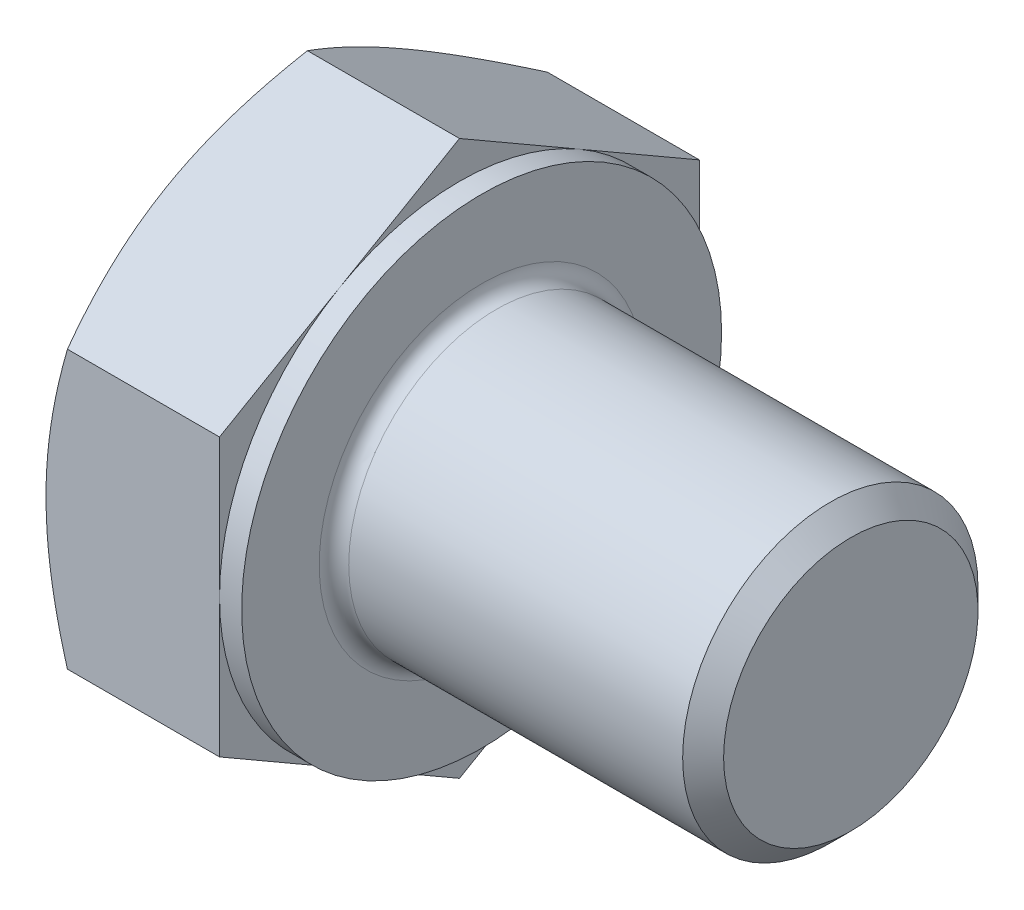
ISO-10303-21;
HEADER;
FILE_DESCRIPTION(('STEP AP214'),'2;1');
FILE_NAME('part.step','',(''),(''),'','','');
FILE_SCHEMA(('AUTOMOTIVE_DESIGN { 1 0 10303 214 1 1 1 1 }'));
ENDSEC;
DATA;
#1=APPLICATION_CONTEXT('core data for automotive mechanical design processes');
#2=APPLICATION_PROTOCOL_DEFINITION('international standard','automotive_design',2000,#1);
#3=PRODUCT_CONTEXT('',#1,'mechanical');
#4=PRODUCT('Part','Part','',(#3));
#5=PRODUCT_RELATED_PRODUCT_CATEGORY('part','',(#4));
#6=PRODUCT_DEFINITION_FORMATION('','',#4);
#7=PRODUCT_DEFINITION_CONTEXT('part definition',#1,'design');
#8=PRODUCT_DEFINITION('design','',#6,#7);
#9=PRODUCT_DEFINITION_SHAPE('','',#8);
#10=(LENGTH_UNIT() NAMED_UNIT(*) SI_UNIT(.MILLI.,.METRE.));
#11=(NAMED_UNIT(*) PLANE_ANGLE_UNIT() SI_UNIT($,.RADIAN.));
#12=(NAMED_UNIT(*) SI_UNIT($,.STERADIAN.) SOLID_ANGLE_UNIT());
#13=UNCERTAINTY_MEASURE_WITH_UNIT(LENGTH_MEASURE(1.E-05),#10,'distance_accuracy_value','');
#14=(GEOMETRIC_REPRESENTATION_CONTEXT(3) GLOBAL_UNCERTAINTY_ASSIGNED_CONTEXT((#13)) GLOBAL_UNIT_ASSIGNED_CONTEXT((#10,
#11,#12)) REPRESENTATION_CONTEXT('',''));
#15=CARTESIAN_POINT('',(0.,0.,0.));
#16=DIRECTION('',(0.,0.,1.));
#17=DIRECTION('',(1.,0.,0.));
#18=AXIS2_PLACEMENT_3D('',#15,#16,#17);
#19=CARTESIAN_POINT('',(5.3,7.50555349946514,0.));
#20=DIRECTION('',(1.,0.,0.));
#21=DIRECTION('',(0.,0.,-1.));
#22=AXIS2_PLACEMENT_3D('',#19,#20,#21);
#23=PLANE('',#22);
#24=CARTESIAN_POINT('',(5.3,0.,0.));
#25=DIRECTION('',(1.,0.,0.));
#26=DIRECTION('',(0.,0.,-1.));
#27=AXIS2_PLACEMENT_3D('',#24,#25,#26);
#28=CIRCLE('',#27,4.4);
#29=CARTESIAN_POINT('',(5.3,0.,-4.4));
#30=VERTEX_POINT('',#29);
#31=EDGE_CURVE('E44',#30,#30,#28,.F.);
#32=ORIENTED_EDGE('',*,*,#31,.T.);
#33=EDGE_LOOP('',(#32));
#34=FACE_BOUND('',#33,.T.);
#35=CARTESIAN_POINT('',(5.3,0.,0.));
#36=DIRECTION('',(1.,0.,0.));
#37=DIRECTION('',(0.,0.,-1.));
#38=AXIS2_PLACEMENT_3D('',#35,#36,#37);
#39=CIRCLE('',#38,6.5);
#40=CARTESIAN_POINT('',(5.3,0.,-6.5));
#41=VERTEX_POINT('',#40);
#42=EDGE_CURVE('E301',#41,#41,#39,.T.);
#43=ORIENTED_EDGE('',*,*,#42,.T.);
#44=EDGE_LOOP('',(#43));
#45=FACE_BOUND('',#44,.T.);
#46=ADVANCED_FACE('F36',(#34,#45),#23,.T.);
#47=CARTESIAN_POINT('',(0.,0.,0.));
#48=DIRECTION('',(-1.,0.,0.));
#49=DIRECTION('',(0.,0.,1.));
#50=AXIS2_PLACEMENT_3D('',#47,#48,#49);
#51=CYLINDRICAL_SURFACE('',#50,4.);
#52=CARTESIAN_POINT('',(5.7,0.,0.));
#53=DIRECTION('',(1.,0.,0.));
#54=DIRECTION('',(0.,0.,-1.));
#55=AXIS2_PLACEMENT_3D('',#52,#53,#54);
#56=CIRCLE('',#55,4.);
#57=CARTESIAN_POINT('',(5.7,0.,-4.));
#58=VERTEX_POINT('',#57);
#59=EDGE_CURVE('E11',#58,#58,#56,.T.);
#60=ORIENTED_EDGE('',*,*,#59,.T.);
#61=EDGE_LOOP('',(#60));
#62=FACE_BOUND('',#61,.T.);
#63=CARTESIAN_POINT('',(14.7455,0.,0.));
#64=DIRECTION('',(-1.,0.,0.));
#65=DIRECTION('',(0.,0.,1.));
#66=AXIS2_PLACEMENT_3D('',#63,#64,#65);
#67=CIRCLE('',#66,4.);
#68=CARTESIAN_POINT('',(14.7455,0.,4.));
#69=VERTEX_POINT('',#68);
#70=EDGE_CURVE('E280',#69,#69,#67,.T.);
#71=ORIENTED_EDGE('',*,*,#70,.T.);
#72=EDGE_LOOP('',(#71));
#73=FACE_BOUND('',#72,.T.);
#74=ADVANCED_FACE('F254',(#62,#73),#51,.T.);
#75=CARTESIAN_POINT('',(15.3,0.,0.));
#76=DIRECTION('',(-1.,0.,0.));
#77=DIRECTION('',(0.,0.,1.));
#78=AXIS2_PLACEMENT_3D('',#75,#76,#77);
#79=CONICAL_SURFACE('',#78,3.4455,0.785398163397452);
#80=ORIENTED_EDGE('',*,*,#70,.F.);
#81=EDGE_LOOP('',(#80));
#82=FACE_BOUND('',#81,.T.);
#83=CARTESIAN_POINT('',(15.3,0.,0.));
#84=DIRECTION('',(-1.,0.,0.));
#85=DIRECTION('',(0.,0.,1.));
#86=AXIS2_PLACEMENT_3D('',#83,#84,#85);
#87=CIRCLE('',#86,3.4455);
#88=CARTESIAN_POINT('',(15.3,0.,3.4455));
#89=VERTEX_POINT('',#88);
#90=EDGE_CURVE('E278',#89,#89,#87,.T.);
#91=ORIENTED_EDGE('',*,*,#90,.T.);
#92=EDGE_LOOP('',(#91));
#93=FACE_BOUND('',#92,.T.);
#94=ADVANCED_FACE('F259',(#82,#93),#79,.T.);
#95=CARTESIAN_POINT('',(15.3,0.,0.));
#96=DIRECTION('',(-1.,0.,0.));
#97=DIRECTION('',(0.,0.,1.));
#98=AXIS2_PLACEMENT_3D('',#95,#96,#97);
#99=PLANE('',#98);
#100=ORIENTED_EDGE('',*,*,#90,.F.);
#101=EDGE_LOOP('',(#100));
#102=FACE_BOUND('',#101,.T.);
#103=ADVANCED_FACE('F266',(#102),#99,.F.);
#104=CARTESIAN_POINT('',(4.7,6.5,0.));
#105=DIRECTION('',(1.,0.,0.));
#106=DIRECTION('',(0.,0.,-1.));
#107=AXIS2_PLACEMENT_3D('',#104,#105,#106);
#108=PLANE('',#107);
#109=DIRECTION('',(0.,0.500000000000001,0.866025403784438));
#110=VECTOR('',#109,1.);
#111=CARTESIAN_POINT('',(4.7,3.75277674973256,-6.5));
#112=LINE('',#111,#110);
#113=CARTESIAN_POINT('',(4.7,3.75277674973256,-6.5));
#114=VERTEX_POINT('',#113);
#115=CARTESIAN_POINT('',(4.7,5.62916512459885,-3.25000000000001));
#116=VERTEX_POINT('',#115);
#117=EDGE_CURVE('E168',#114,#116,#112,.T.);
#118=ORIENTED_EDGE('',*,*,#117,.T.);
#119=CARTESIAN_POINT('',(4.7,0.,0.));
#120=DIRECTION('',(-1.,0.,0.));
#121=DIRECTION('',(0.,0.,1.));
#122=AXIS2_PLACEMENT_3D('',#119,#120,#121);
#123=CIRCLE('',#122,6.5);
#124=CARTESIAN_POINT('',(4.7,0.,-6.5));
#125=VERTEX_POINT('',#124);
#126=EDGE_CURVE('E51',#116,#125,#123,.T.);
#127=ORIENTED_EDGE('',*,*,#126,.T.);
#128=DIRECTION('',(0.,1.,0.));
#129=VECTOR('',#128,1.);
#130=CARTESIAN_POINT('',(4.7,3.75277674973256,-6.5));
#131=LINE('',#130,#129);
#132=EDGE_CURVE('E304',#125,#114,#131,.T.);
#133=ORIENTED_EDGE('',*,*,#132,.T.);
#134=EDGE_LOOP('',(#118,#127,#133));
#135=FACE_BOUND('',#134,.T.);
#136=ADVANCED_FACE('F269',(#135),#108,.T.);
#137=CARTESIAN_POINT('',(4.7,7.50555349946514,0.));
#138=VERTEX_POINT('',#137);
#139=EDGE_CURVE('E166',#116,#138,#112,.T.);
#140=ORIENTED_EDGE('',*,*,#139,.T.);
#141=DIRECTION('',(0.,-0.5,0.866025403784438));
#142=VECTOR('',#141,1.);
#143=CARTESIAN_POINT('',(4.7,7.50555349946514,0.));
#144=LINE('',#143,#142);
#145=CARTESIAN_POINT('',(4.7,5.62916512459885,3.25));
#146=VERTEX_POINT('',#145);
#147=EDGE_CURVE('E165',#138,#146,#144,.T.);
#148=ORIENTED_EDGE('',*,*,#147,.T.);
#149=EDGE_CURVE('E154',#146,#116,#123,.T.);
#150=ORIENTED_EDGE('',*,*,#149,.T.);
#151=EDGE_LOOP('',(#140,#148,#150));
#152=FACE_BOUND('',#151,.T.);
#153=ADVANCED_FACE('F274',(#152),#108,.T.);
#154=CARTESIAN_POINT('',(4.7,3.75277674973257,6.5));
#155=VERTEX_POINT('',#154);
#156=EDGE_CURVE('E133',#146,#155,#144,.T.);
#157=ORIENTED_EDGE('',*,*,#156,.T.);
#158=DIRECTION('',(0.,-1.,0.));
#159=VECTOR('',#158,1.);
#160=CARTESIAN_POINT('',(4.7,3.75277674973257,6.5));
#161=LINE('',#160,#159);
#162=CARTESIAN_POINT('',(4.7,0.,6.5));
#163=VERTEX_POINT('',#162);
#164=EDGE_CURVE('E127',#155,#163,#161,.T.);
#165=ORIENTED_EDGE('',*,*,#164,.T.);
#166=EDGE_CURVE('E131',#163,#146,#123,.T.);
#167=ORIENTED_EDGE('',*,*,#166,.T.);
#168=EDGE_LOOP('',(#157,#165,#167));
#169=FACE_BOUND('',#168,.T.);
#170=ADVANCED_FACE('F129',(#169),#108,.T.);
#171=CARTESIAN_POINT('',(4.7,-3.75277674973256,6.5));
#172=VERTEX_POINT('',#171);
#173=EDGE_CURVE('E137',#163,#172,#161,.T.);
#174=ORIENTED_EDGE('',*,*,#173,.T.);
#175=DIRECTION('',(0.,-0.500000000000002,-0.866025403784437));
#176=VECTOR('',#175,1.);
#177=CARTESIAN_POINT('',(4.7,-7.50555349946515,0.));
#178=LINE('',#177,#176);
#179=CARTESIAN_POINT('',(4.7,-5.62916512459884,3.25000000000001));
#180=VERTEX_POINT('',#179);
#181=EDGE_CURVE('E144',#172,#180,#178,.T.);
#182=ORIENTED_EDGE('',*,*,#181,.T.);
#183=EDGE_CURVE('E141',#180,#163,#123,.T.);
#184=ORIENTED_EDGE('',*,*,#183,.T.);
#185=EDGE_LOOP('',(#174,#182,#184));
#186=FACE_BOUND('',#185,.T.);
#187=ADVANCED_FACE('F142',(#186),#108,.T.);
#188=CARTESIAN_POINT('',(4.7,-7.50555349946515,0.));
#189=VERTEX_POINT('',#188);
#190=EDGE_CURVE('E160',#180,#189,#178,.T.);
#191=ORIENTED_EDGE('',*,*,#190,.T.);
#192=DIRECTION('',(0.,0.5,-0.866025403784438));
#193=VECTOR('',#192,1.);
#194=CARTESIAN_POINT('',(4.7,-3.75277674973258,-6.5));
#195=LINE('',#194,#193);
#196=CARTESIAN_POINT('',(4.7,-5.62916512459885,-3.25));
#197=VERTEX_POINT('',#196);
#198=EDGE_CURVE('E342',#189,#197,#195,.T.);
#199=ORIENTED_EDGE('',*,*,#198,.T.);
#200=EDGE_CURVE('E148',#197,#180,#123,.T.);
#201=ORIENTED_EDGE('',*,*,#200,.T.);
#202=EDGE_LOOP('',(#191,#199,#201));
#203=FACE_BOUND('',#202,.T.);
#204=ADVANCED_FACE('F343',(#203),#108,.T.);
#205=CARTESIAN_POINT('',(4.7,-3.75277674973258,-6.5));
#206=VERTEX_POINT('',#205);
#207=EDGE_CURVE('E155',#197,#206,#195,.T.);
#208=ORIENTED_EDGE('',*,*,#207,.T.);
#209=EDGE_CURVE('E305',#206,#125,#131,.T.);
#210=ORIENTED_EDGE('',*,*,#209,.T.);
#211=EDGE_CURVE('E312',#125,#197,#123,.T.);
#212=ORIENTED_EDGE('',*,*,#211,.T.);
#213=EDGE_LOOP('',(#208,#210,#212));
#214=FACE_BOUND('',#213,.T.);
#215=ADVANCED_FACE('F275',(#214),#108,.T.);
#216=CARTESIAN_POINT('',(0.,0.,0.));
#217=DIRECTION('',(-1.,0.,0.));
#218=DIRECTION('',(0.,0.,1.));
#219=AXIS2_PLACEMENT_3D('',#216,#217,#218);
#220=CYLINDRICAL_SURFACE('',#219,6.5);
#221=ORIENTED_EDGE('',*,*,#126,.F.);
#222=ORIENTED_EDGE('',*,*,#149,.F.);
#223=ORIENTED_EDGE('',*,*,#166,.F.);
#224=ORIENTED_EDGE('',*,*,#183,.F.);
#225=ORIENTED_EDGE('',*,*,#200,.F.);
#226=ORIENTED_EDGE('',*,*,#211,.F.);
#227=EDGE_LOOP('',(#221,#222,#223,#224,#225,#226));
#228=FACE_BOUND('',#227,.T.);
#229=ORIENTED_EDGE('',*,*,#42,.F.);
#230=EDGE_LOOP('',(#229));
#231=FACE_BOUND('',#230,.T.);
#232=ADVANCED_FACE('F151',(#228,#231),#220,.T.);
#233=CARTESIAN_POINT('',(0.,7.50555349946514,0.));
#234=DIRECTION('',(1.,0.,0.));
#235=DIRECTION('',(0.,0.,-1.));
#236=AXIS2_PLACEMENT_3D('',#233,#234,#235);
#237=PLANE('',#236);
#238=CARTESIAN_POINT('',(0.,0.,0.));
#239=DIRECTION('',(1.,0.,0.));
#240=DIRECTION('',(0.,0.,-1.));
#241=AXIS2_PLACEMENT_3D('',#238,#239,#240);
#242=CIRCLE('',#241,6.5);
#243=CARTESIAN_POINT('',(0.,0.,-6.5));
#244=VERTEX_POINT('',#243);
#245=CARTESIAN_POINT('',(0.,5.62916512459885,-3.25000000000001));
#246=VERTEX_POINT('',#245);
#247=EDGE_CURVE('E300',#244,#246,#242,.T.);
#248=ORIENTED_EDGE('',*,*,#247,.F.);
#249=CARTESIAN_POINT('',(0.,-5.62916512459885,-3.25));
#250=VERTEX_POINT('',#249);
#251=EDGE_CURVE('E296',#250,#244,#242,.T.);
#252=ORIENTED_EDGE('',*,*,#251,.F.);
#253=CARTESIAN_POINT('',(0.,-5.62916512459884,3.25000000000001));
#254=VERTEX_POINT('',#253);
#255=EDGE_CURVE('E299',#254,#250,#242,.T.);
#256=ORIENTED_EDGE('',*,*,#255,.F.);
#257=CARTESIAN_POINT('',(0.,0.,6.5));
#258=VERTEX_POINT('',#257);
#259=EDGE_CURVE('E335',#258,#254,#242,.T.);
#260=ORIENTED_EDGE('',*,*,#259,.F.);
#261=CARTESIAN_POINT('',(0.,0.,0.));
#262=DIRECTION('',(-1.,0.,0.));
#263=DIRECTION('',(0.,0.,1.));
#264=AXIS2_PLACEMENT_3D('',#261,#262,#263);
#265=CIRCLE('',#264,6.5);
#266=CARTESIAN_POINT('',(0.,5.62916512459885,3.25));
#267=VERTEX_POINT('',#266);
#268=EDGE_CURVE('E169',#258,#267,#265,.T.);
#269=ORIENTED_EDGE('',*,*,#268,.T.);
#270=EDGE_CURVE('E358',#246,#267,#242,.T.);
#271=ORIENTED_EDGE('',*,*,#270,.F.);
#272=EDGE_LOOP('',(#248,#252,#256,#260,#269,#271));
#273=FACE_BOUND('',#272,.T.);
#274=ADVANCED_FACE('F200',(#273),#237,.F.);
#275=CARTESIAN_POINT('',(0.,0.,0.));
#276=DIRECTION('',(1.,0.,0.));
#277=DIRECTION('',(0.,0.,-1.));
#278=AXIS2_PLACEMENT_3D('',#275,#276,#277);
#279=CONICAL_SURFACE('',#278,6.5,1.0471975511966);
#280=CARTESIAN_POINT('',(0.580623251805867,3.75266127967873,6.5002));
#281=CARTESIAN_POINT('',(0.533004423075485,3.83515161912751,6.35732254094112));
#282=CARTESIAN_POINT('',(0.487546700602706,3.91794952254313,6.21391236546508));
#283=CARTESIAN_POINT('',(0.401548682023045,4.08421773795795,5.9259273686828));
#284=CARTESIAN_POINT('',(0.361010507228025,4.16768832359106,5.78135207342873));
#285=CARTESIAN_POINT('',(0.247571001123208,4.41943655294052,5.34531134947996));
#286=CARTESIAN_POINT('',(0.183047807128739,4.5887079340369,5.05212471715368));
#287=CARTESIAN_POINT('',(0.107386583547492,4.84201947708215,4.61337625445562));
#288=CARTESIAN_POINT('',(0.0858328564569887,4.92530276780316,4.46912536350531));
#289=CARTESIAN_POINT('',(0.0496903146061205,5.09224566542477,4.17997178286191));
#290=CARTESIAN_POINT('',(0.0351008844596681,5.17590523841628,4.03506915190111));
#291=CARTESIAN_POINT('',(0.0132587525073484,5.34336968579964,3.74501222057168));
#292=CARTESIAN_POINT('',(0.00599772432210961,5.427174286676,3.59985839394579));
#293=CARTESIAN_POINT('',(-0.0010396974177666,5.59485627940484,3.30942466302505));
#294=CARTESIAN_POINT('',(-0.000816322187793267,5.67873366892861,3.16414476276364));
#295=CARTESIAN_POINT('',(0.0100834585151673,5.90853103021318,2.7661240575735));
#296=CARTESIAN_POINT('',(0.0283818178694151,6.05437578112764,2.51351353897243));
#297=CARTESIAN_POINT('',(0.0864063414576771,6.34509659313135,2.00997032176432));
#298=CARTESIAN_POINT('',(0.126152338538247,6.48997163178545,1.75903939406692));
#299=CARTESIAN_POINT('',(0.225505903202152,6.78127752911039,1.25448277935568));
#300=CARTESIAN_POINT('',(0.285534425638029,6.92767163007068,1.00092075856408));
#301=CARTESIAN_POINT('',(0.421774992509871,7.21827667013277,0.497578064240954));
#302=CARTESIAN_POINT('',(0.497955034163595,7.36249133098589,0.247790944447035));
#303=CARTESIAN_POINT('',(0.58062325180587,7.50566896951898,-0.00020000000000043));
#304=B_SPLINE_CURVE_WITH_KNOTS('',3,(#280,#281,#282,#283,#284,#285,#286,#287,#288,#289,#290,
#291,#292,#293,#294,#295,#296,#297,#298,#299,#300,#301,#302,#303),.UNSPECIFIED.,.F.,.F.,(4,2,2,
2,2,2,2,2,2,2,2,4),(0.,0.515105052395588,1.03043143507524,2.06322554824262,2.56697389547996,
3.07067772176454,3.57380860368928,4.0769239424252,4.9527935470566,5.82947446853466,
6.72559912449736,7.61996451221046),.UNSPECIFIED.);
#305=CARTESIAN_POINT('',(0.580556583600766,7.50555349946514,0.));
#306=VERTEX_POINT('',#305);
#307=EDGE_CURVE('E220',#267,#306,#304,.T.);
#308=ORIENTED_EDGE('',*,*,#307,.T.);
#309=CARTESIAN_POINT('',(0.58062325180587,7.50566896951898,0.0002));
#310=CARTESIAN_POINT('',(0.533004423075488,7.4231786300702,-0.14267745905888));
#311=CARTESIAN_POINT('',(0.487546700602709,7.34038072665458,-0.286087634534913));
#312=CARTESIAN_POINT('',(0.401548682023048,7.17411251123976,-0.574072631317194));
#313=CARTESIAN_POINT('',(0.361010507228027,7.09064192560665,-0.718647926571264));
#314=CARTESIAN_POINT('',(0.24757100112321,6.83889369625719,-1.15468865052003));
#315=CARTESIAN_POINT('',(0.183047807128741,6.66962231516081,-1.44787528284632));
#316=CARTESIAN_POINT('',(0.107386583547493,6.41631077211555,-1.88662374554437));
#317=CARTESIAN_POINT('',(0.0858328564569883,6.33302748139454,-2.03087463649469));
#318=CARTESIAN_POINT('',(0.0496903146061195,6.16608458377293,-2.32002821713809));
#319=CARTESIAN_POINT('',(0.0351008844596671,6.08242501078143,-2.46493084809889));
#320=CARTESIAN_POINT('',(0.0132587525073473,5.91496056339807,-2.75498777942832));
#321=CARTESIAN_POINT('',(0.00599772432210834,5.8311559625217,-2.90014160605421));
#322=CARTESIAN_POINT('',(-0.00103969741776833,5.66347396979287,-3.19057533697495));
#323=CARTESIAN_POINT('',(-0.000816322187795318,5.5795965802691,-3.33585523723636));
#324=CARTESIAN_POINT('',(0.0100834585151647,5.34979921898453,-3.73387594242649));
#325=CARTESIAN_POINT('',(0.0283818178694125,5.20395446807007,-3.98648646102757));
#326=CARTESIAN_POINT('',(0.086406341457674,4.91323365606635,-4.49002967823568));
#327=CARTESIAN_POINT('',(0.126152338538244,4.76835861741225,-4.74096060593308));
#328=CARTESIAN_POINT('',(0.225505903202148,4.47705272008731,-5.24551722064432));
#329=CARTESIAN_POINT('',(0.285534425638025,4.33065861912702,-5.49907924143591));
#330=CARTESIAN_POINT('',(0.421774992509866,4.04005357906493,-6.00242193575904));
#331=CARTESIAN_POINT('',(0.49795503416359,3.89583891821181,-6.25220905555296));
#332=CARTESIAN_POINT('',(0.580623251805865,3.75266127967872,-6.5002));
#333=B_SPLINE_CURVE_WITH_KNOTS('',3,(#309,#310,#311,#312,#313,#314,#315,#316,#317,#318,#319,
#320,#321,#322,#323,#324,#325,#326,#327,#328,#329,#330,#331,#332),.UNSPECIFIED.,.F.,.F.,(4,2,2,
2,2,2,2,2,2,2,2,4),(0.,0.515105052395588,1.03043143507524,2.06322554824262,2.56697389547997,
3.07067772176454,3.57380860368928,4.0769239424252,4.9527935470566,5.82947446853467,
6.72559912449737,7.61996451221046),.UNSPECIFIED.);
#334=EDGE_CURVE('E59',#306,#246,#333,.T.);
#335=ORIENTED_EDGE('',*,*,#334,.T.);
#336=ORIENTED_EDGE('',*,*,#270,.T.);
#337=EDGE_LOOP('',(#308,#335,#336));
#338=FACE_BOUND('',#337,.T.);
#339=ADVANCED_FACE('F359',(#338),#279,.T.);
#340=CARTESIAN_POINT('',(3.18835311590245,-10.1137456678934,6.5));
#341=CARTESIAN_POINT('',(3.05034774010467,-9.82952666322136,6.5));
#342=CARTESIAN_POINT('',(2.91365616489937,-9.54465869649272,6.5));
#343=CARTESIAN_POINT('',(2.64363899497541,-8.9732797805792,6.5));
#344=CARTESIAN_POINT('',(2.51031392459096,-8.6867685838847,6.5));
#345=CARTESIAN_POINT('',(2.24710473482718,-8.11029837842687,6.5));
#346=CARTESIAN_POINT('',(2.1172430043868,-7.8203291120151,6.5));
#347=CARTESIAN_POINT('',(1.86279082826902,-7.23809541022338,6.5));
#348=CARTESIAN_POINT('',(1.73820013554674,-6.94583108317206,6.5));
#349=CARTESIAN_POINT('',(1.49176685426961,-6.34906440963035,6.5));
#350=CARTESIAN_POINT('',(1.37014257641265,-6.04447142288871,6.5));
#351=CARTESIAN_POINT('',(1.13601865758149,-5.43173420957314,6.5));
#352=CARTESIAN_POINT('',(1.02352003558022,-5.12358959079845,6.5));
#353=CARTESIAN_POINT('',(0.810575368239914,-4.50382569782258,6.5));
#354=CARTESIAN_POINT('',(0.710105232302002,-4.19221478266991,6.5));
#355=CARTESIAN_POINT('',(0.524420166144451,-3.56452019206011,6.5));
#356=CARTESIAN_POINT('',(0.439200468206415,-3.24843794792919,6.5));
#357=CARTESIAN_POINT('',(0.288524223401195,-2.61335465712781,6.5));
#358=CARTESIAN_POINT('',(0.222961865744746,-2.29437912059504,6.5));
#359=CARTESIAN_POINT('',(0.115312883130723,-1.65238219405861,6.5));
#360=CARTESIAN_POINT('',(0.073223901469062,-1.32936121354429,6.5));
#361=CARTESIAN_POINT('',(0.0304887136381656,-0.845231171839972,6.5));
#362=CARTESIAN_POINT('',(0.0196493434273837,-0.68498220966309,6.5));
#363=CARTESIAN_POINT('',(0.00475298486143966,-0.364162349065447,6.5));
#364=CARTESIAN_POINT('',(0.000695882908831978,-0.203591456081867,6.5));
#365=CARTESIAN_POINT('',(-0.000531597190094924,0.11757743037431,6.5));
#366=CARTESIAN_POINT('',(0.00229809017012709,0.278175424090155,6.5));
#367=CARTESIAN_POINT('',(0.0147726845547646,0.599108972823518,6.5));
#368=CARTESIAN_POINT('',(0.0244179260500529,0.75944451457423,6.5));
#369=CARTESIAN_POINT('',(0.0554961939343018,1.14369946602535,6.5));
#370=CARTESIAN_POINT('',(0.0801030490514536,1.36736763045087,6.5));
#371=CARTESIAN_POINT('',(0.14124653745338,1.81305591311689,6.5));
#372=CARTESIAN_POINT('',(0.177784759614454,2.0350758078311,6.5));
#373=CARTESIAN_POINT('',(0.303360001332118,2.69839633433797,6.5));
#374=CARTESIAN_POINT('',(0.408335815147598,3.13672010374358,6.5));
#375=CARTESIAN_POINT('',(0.590564593134945,3.7923211291812,6.5));
#376=CARTESIAN_POINT('',(0.656313198979096,4.01299150874074,6.5));
#377=CARTESIAN_POINT('',(0.794681634200736,4.45218859008392,6.5));
#378=CARTESIAN_POINT('',(0.867301513122621,4.6707152763982,6.5));
#379=CARTESIAN_POINT('',(1.01824353854295,5.10569490252727,6.5));
#380=CARTESIAN_POINT('',(1.09656388232839,5.32214847365077,6.5));
#381=CARTESIAN_POINT('',(1.25798086164822,5.7532572577304,6.5));
#382=CARTESIAN_POINT('',(1.34107741035996,5.96791250329558,6.5));
#383=CARTESIAN_POINT('',(1.56029019583041,6.51888445936374,6.5));
#384=CARTESIAN_POINT('',(1.69936356666534,6.85402316813628,6.5));
#385=CARTESIAN_POINT('',(1.98501958087353,7.52109583939394,6.5));
#386=CARTESIAN_POINT('',(2.13160288780792,7.85302951559934,6.5));
#387=CARTESIAN_POINT('',(2.43059748044952,8.51437865518659,6.5));
#388=CARTESIAN_POINT('',(2.5830105759696,8.84379329784095,6.5));
#389=CARTESIAN_POINT('',(2.89234869374927,9.50047798683785,6.5));
#390=CARTESIAN_POINT('',(3.04927357220059,9.82774810112758,6.49999999999999));
#391=CARTESIAN_POINT('',(3.36692013130637,10.4809971975748,6.49999999999999));
#392=CARTESIAN_POINT('',(3.52764676491733,10.8069737667408,6.49999999999999));
#393=CARTESIAN_POINT('',(3.851985555549,11.4574882901034,6.49999999999999));
#394=CARTESIAN_POINT('',(4.01559773123066,11.7820262349792,6.49999999999999));
#395=CARTESIAN_POINT('',(4.50986185003774,12.7537468114441,6.49999999999999));
#396=CARTESIAN_POINT('',(4.84399997978541,13.3991555932469,6.49999999999999));
#397=CARTESIAN_POINT('',(5.4857599026592,14.6239779290894,6.49999999999999));
#398=CARTESIAN_POINT('',(5.79279643372279,15.2036995760604,6.49999999999999));
#399=CARTESIAN_POINT('',(6.4106918822763,16.3611382637875,6.49999999999999));
#400=CARTESIAN_POINT('',(6.72155099010109,16.938855202873,6.49999999999999));
#401=CARTESIAN_POINT('',(7.34519775439015,18.0910273555999,6.49999999999999));
#402=CARTESIAN_POINT('',(7.65797694168864,18.665487160613,6.49999999999999));
#403=CARTESIAN_POINT('',(8.28574397153079,19.8131486204439,6.49999999999999));
#404=CARTESIAN_POINT('',(8.60073166294279,20.3863503578957,6.49999999999999));
#405=CARTESIAN_POINT('',(8.91652967168742,20.9591024521449,6.49999999999999));
#406=B_SPLINE_CURVE_WITH_KNOTS('',3,(#340,#341,#342,#343,#344,#345,#346,#347,#348,#349,#350,
#351,#352,#353,#354,#355,#356,#357,#358,#359,#360,#361,#362,#363,#364,#365,#366,#367,#368,#369,
#370,#371,#372,#373,#374,#375,#376,#377,#378,#379,#380,#381,#382,#383,#384,#385,#386,#387,#388,
#389,#390,#391,#392,#393,#394,#395,#396,#397,#398,#399,#400,#401,#402,#403,#404,#405),
.UNSPECIFIED.,.F.,.F.,(4,2,2,2,2,2,2,2,2,2,2,2,2,2,2,2,2,2,2,2,2,2,2,2,2,2,2,2,2,2,2,2,4),(0.,
0.947868666702312,1.89588406483492,2.84900320930536,3.80207763304314,4.7858977408271,
5.76982755141752,6.75175256246685,7.73337005764393,8.70960474890991,9.68574140951123,
10.1674651053568,10.6491807326436,11.1309009419855,11.6126447932157,12.287317572382,
12.9620802330383,14.312318438093,15.0030310344276,15.6937486114326,16.384248697357,
17.0747362352244,18.1631508683747,19.2516618378193,20.3405135142583,21.4293305231019,
22.5196540547636,23.6099846401957,25.7902468235016,27.7582608872418,29.7263733429304,
31.6886408595598,33.6507753806319),.UNSPECIFIED.);
#407=CARTESIAN_POINT('',(0.580556583600762,3.75277674973257,6.5));
#408=VERTEX_POINT('',#407);
#409=EDGE_CURVE('E234',#258,#408,#406,.T.);
#410=ORIENTED_EDGE('',*,*,#409,.T.);
#411=EDGE_CURVE('E233',#408,#267,#304,.T.);
#412=ORIENTED_EDGE('',*,*,#411,.T.);
#413=ORIENTED_EDGE('',*,*,#268,.F.);
#414=EDGE_LOOP('',(#410,#412,#413));
#415=FACE_BOUND('',#414,.T.);
#416=ADVANCED_FACE('F329',(#415),#279,.T.);
#417=CARTESIAN_POINT('',(0.580556583600761,-3.75277674973256,6.5));
#418=VERTEX_POINT('',#417);
#419=EDGE_CURVE('E281',#418,#258,#406,.T.);
#420=ORIENTED_EDGE('',*,*,#419,.T.);
#421=ORIENTED_EDGE('',*,*,#259,.T.);
#422=CARTESIAN_POINT('',(0.580623251805874,-7.50566896951899,-0.000200000000000067));
#423=CARTESIAN_POINT('',(0.533004423075492,-7.42317863007021,0.14267745905888));
#424=CARTESIAN_POINT('',(0.487546700602713,-7.34038072665459,0.286087634534913));
#425=CARTESIAN_POINT('',(0.401548682023052,-7.17411251123977,0.574072631317194));
#426=CARTESIAN_POINT('',(0.361010507228031,-7.09064192560666,0.718647926571264));
#427=CARTESIAN_POINT('',(0.247571001123214,-6.8388936962572,1.15468865052003));
#428=CARTESIAN_POINT('',(0.183047807128744,-6.66962231516081,1.44787528284632));
#429=CARTESIAN_POINT('',(0.107386583547496,-6.41631077211556,1.88662374554437));
#430=CARTESIAN_POINT('',(0.0858328564569914,-6.33302748139455,2.03087463649469));
#431=CARTESIAN_POINT('',(0.0496903146061227,-6.16608458377294,2.32002821713809));
#432=CARTESIAN_POINT('',(0.0351008844596702,-6.08242501078143,2.46493084809889));
#433=CARTESIAN_POINT('',(0.0132587525073498,-5.91496056339807,2.75498777942832));
#434=CARTESIAN_POINT('',(0.00599772432211037,-5.83115596252171,2.90014160605421));
#435=CARTESIAN_POINT('',(-0.0010396974177666,-5.66347396979287,3.19057533697495));
#436=CARTESIAN_POINT('',(-0.000816322187793436,-5.5795965802691,3.33585523723636));
#437=CARTESIAN_POINT('',(0.0100834585151666,-5.34979921898453,3.73387594242649));
#438=CARTESIAN_POINT('',(0.0283818178694139,-5.20395446807007,3.98648646102757));
#439=CARTESIAN_POINT('',(0.0864063414576748,-4.91323365606635,4.49002967823568));
#440=CARTESIAN_POINT('',(0.126152338538244,-4.76835861741226,4.74096060593308));
#441=CARTESIAN_POINT('',(0.225505903202148,-4.47705272008731,5.24551722064432));
#442=CARTESIAN_POINT('',(0.285534425638025,-4.33065861912702,5.49907924143591));
#443=CARTESIAN_POINT('',(0.421774992509867,-4.04005357906493,6.00242193575904));
#444=CARTESIAN_POINT('',(0.497955034163591,-3.89583891821181,6.25220905555296));
#445=CARTESIAN_POINT('',(0.580623251805865,-3.75266127967872,6.5002));
#446=B_SPLINE_CURVE_WITH_KNOTS('',3,(#422,#423,#424,#425,#426,#427,#428,#429,#430,#431,#432,
#433,#434,#435,#436,#437,#438,#439,#440,#441,#442,#443,#444,#445),.UNSPECIFIED.,.F.,.F.,(4,2,2,
2,2,2,2,2,2,2,2,4),(0.,0.515105052395588,1.03043143507525,2.06322554824263,2.56697389547997,
3.07067772176454,3.57380860368928,4.07692394242521,4.95279354705661,5.82947446853467,
6.72559912449737,7.61996451221046),.UNSPECIFIED.);
#447=EDGE_CURVE('E222',#254,#418,#446,.T.);
#448=ORIENTED_EDGE('',*,*,#447,.T.);
#449=EDGE_LOOP('',(#420,#421,#448));
#450=FACE_BOUND('',#449,.T.);
#451=ADVANCED_FACE('F189',(#450),#279,.T.);
#452=CARTESIAN_POINT('',(0.58055658360077,-7.50555349946515,0.));
#453=VERTEX_POINT('',#452);
#454=EDGE_CURVE('E214',#453,#254,#446,.T.);
#455=ORIENTED_EDGE('',*,*,#454,.T.);
#456=ORIENTED_EDGE('',*,*,#255,.T.);
#457=CARTESIAN_POINT('',(0.58062325180587,-3.75266127967874,-6.5002));
#458=CARTESIAN_POINT('',(0.533004423075488,-3.83515161912751,-6.35732254094112));
#459=CARTESIAN_POINT('',(0.487546700602709,-3.91794952254313,-6.21391236546509));
#460=CARTESIAN_POINT('',(0.401548682023049,-4.08421773795795,-5.9259273686828));
#461=CARTESIAN_POINT('',(0.361010507228028,-4.16768832359106,-5.78135207342874));
#462=CARTESIAN_POINT('',(0.247571001123212,-4.41943655294052,-5.34531134947997));
#463=CARTESIAN_POINT('',(0.183047807128743,-4.58870793403691,-5.05212471715368));
#464=CARTESIAN_POINT('',(0.107386583547496,-4.84201947708216,-4.61337625445563));
#465=CARTESIAN_POINT('',(0.0858328564569917,-4.92530276780317,-4.46912536350531));
#466=CARTESIAN_POINT('',(0.0496903146061238,-5.09224566542478,-4.17997178286191));
#467=CARTESIAN_POINT('',(0.0351008844596717,-5.17590523841628,-4.03506915190111));
#468=CARTESIAN_POINT('',(0.0132587525073523,-5.34336968579965,-3.74501222057168));
#469=CARTESIAN_POINT('',(0.00599772432211329,-5.42717428667601,-3.59985839394579));
#470=CARTESIAN_POINT('',(-0.001039697417763,-5.59485627940485,-3.30942466302505));
#471=CARTESIAN_POINT('',(-0.000816322187789633,-5.67873366892861,-3.16414476276364));
#472=CARTESIAN_POINT('',(0.0100834585151713,-5.90853103021318,-2.7661240575735));
#473=CARTESIAN_POINT('',(0.0283818178694195,-6.05437578112764,-2.51351353897243));
#474=CARTESIAN_POINT('',(0.0864063414576818,-6.34509659313136,-2.00997032176432));
#475=CARTESIAN_POINT('',(0.126152338538252,-6.48997163178546,-1.75903939406692));
#476=CARTESIAN_POINT('',(0.225505903202157,-6.7812775291104,-1.25448277935568));
#477=CARTESIAN_POINT('',(0.285534425638034,-6.92767163007069,-1.00092075856408));
#478=CARTESIAN_POINT('',(0.421774992509875,-7.21827667013278,-0.497578064240953));
#479=CARTESIAN_POINT('',(0.4979550341636,-7.3624913309859,-0.247790944447034));
#480=CARTESIAN_POINT('',(0.580623251805875,-7.50566896951899,0.000200000000001387));
#481=B_SPLINE_CURVE_WITH_KNOTS('',3,(#457,#458,#459,#460,#461,#462,#463,#464,#465,#466,#467,
#468,#469,#470,#471,#472,#473,#474,#475,#476,#477,#478,#479,#480),.UNSPECIFIED.,.F.,.F.,(4,2,2,
2,2,2,2,2,2,2,2,4),(0.,0.515105052395588,1.03043143507524,2.06322554824262,2.56697389547996,
3.07067772176454,3.57380860368928,4.0769239424252,4.9527935470566,5.82947446853467,
6.72559912449737,7.61996451221046),.UNSPECIFIED.);
#482=EDGE_CURVE('E221',#250,#453,#481,.T.);
#483=ORIENTED_EDGE('',*,*,#482,.T.);
#484=EDGE_LOOP('',(#455,#456,#483));
#485=FACE_BOUND('',#484,.T.);
#486=ADVANCED_FACE('F357',(#485),#279,.T.);
#487=CARTESIAN_POINT('',(0.580556583600761,3.75277674973256,-6.5));
#488=VERTEX_POINT('',#487);
#489=EDGE_CURVE('E223',#246,#488,#333,.T.);
#490=ORIENTED_EDGE('',*,*,#489,.T.);
#491=CARTESIAN_POINT('',(3.18835311590246,-10.1137456678934,-6.5));
#492=CARTESIAN_POINT('',(3.05034774010468,-9.82952666322138,-6.5));
#493=CARTESIAN_POINT('',(2.91365616489938,-9.54465869649274,-6.5));
#494=CARTESIAN_POINT('',(2.64363899497542,-8.97327978057922,-6.5));
#495=CARTESIAN_POINT('',(2.51031392459097,-8.68676858388472,-6.5));
#496=CARTESIAN_POINT('',(2.24710473482719,-8.11029837842689,-6.5));
#497=CARTESIAN_POINT('',(2.1172430043868,-7.82032911201512,-6.5));
#498=CARTESIAN_POINT('',(1.86279082826903,-7.2380954102234,-6.5));
#499=CARTESIAN_POINT('',(1.73820013554674,-6.94583108317207,-6.5));
#500=CARTESIAN_POINT('',(1.49176685426961,-6.34906440963036,-6.5));
#501=CARTESIAN_POINT('',(1.37014257641265,-6.04447142288872,-6.5));
#502=CARTESIAN_POINT('',(1.13601865758149,-5.43173420957315,-6.5));
#503=CARTESIAN_POINT('',(1.02352003558022,-5.12358959079846,-6.5));
#504=CARTESIAN_POINT('',(0.810575368239918,-4.5038256978226,-6.5));
#505=CARTESIAN_POINT('',(0.710105232302005,-4.19221478266993,-6.5));
#506=CARTESIAN_POINT('',(0.524420166144454,-3.56452019206012,-6.5));
#507=CARTESIAN_POINT('',(0.439200468206418,-3.24843794792921,-6.5));
#508=CARTESIAN_POINT('',(0.288524223401198,-2.61335465712783,-6.5));
#509=CARTESIAN_POINT('',(0.222961865744749,-2.29437912059505,-6.5));
#510=CARTESIAN_POINT('',(0.115312883130726,-1.65238219405863,-6.5));
#511=CARTESIAN_POINT('',(0.0732239014690644,-1.3293612135443,-6.5));
#512=CARTESIAN_POINT('',(0.0304887136381672,-0.845231171839986,-6.5));
#513=CARTESIAN_POINT('',(0.0196493434273849,-0.684982209663103,-6.5));
#514=CARTESIAN_POINT('',(0.00475298486144032,-0.36416234906546,-6.5));
#515=CARTESIAN_POINT('',(0.000695882908832543,-0.203591456081879,-6.5));
#516=CARTESIAN_POINT('',(-0.000531597190094495,0.117577430374297,-6.5));
#517=CARTESIAN_POINT('',(0.00229809017012745,0.278175424090143,-6.5));
#518=CARTESIAN_POINT('',(0.0147726845547644,0.599108972823505,-6.5));
#519=CARTESIAN_POINT('',(0.0244179260500523,0.759444514574218,-6.5));
#520=CARTESIAN_POINT('',(0.0554961939343006,1.14369946602534,-6.5));
#521=CARTESIAN_POINT('',(0.0801030490514523,1.36736763045086,-6.5));
#522=CARTESIAN_POINT('',(0.141246537453378,1.81305591311688,-6.5));
#523=CARTESIAN_POINT('',(0.177784759614453,2.03507580783108,-6.5));
#524=CARTESIAN_POINT('',(0.303360001332116,2.69839633433796,-6.5));
#525=CARTESIAN_POINT('',(0.408335815147595,3.13672010374357,-6.5));
#526=CARTESIAN_POINT('',(0.590564593134941,3.79232112918118,-6.5));
#527=CARTESIAN_POINT('',(0.656313198979092,4.01299150874073,-6.5));
#528=CARTESIAN_POINT('',(0.794681634200732,4.45218859008391,-6.5));
#529=CARTESIAN_POINT('',(0.867301513122618,4.67071527639819,-6.5));
#530=CARTESIAN_POINT('',(1.01824353854295,5.10569490252726,-6.5));
#531=CARTESIAN_POINT('',(1.09656388232839,5.32214847365076,-6.5));
#532=CARTESIAN_POINT('',(1.25798086164821,5.75325725773039,-6.5));
#533=CARTESIAN_POINT('',(1.34107741035995,5.96791250329556,-6.5));
#534=CARTESIAN_POINT('',(1.56029019583041,6.51888445936372,-6.5));
#535=CARTESIAN_POINT('',(1.69936356666534,6.85402316813626,-6.5));
#536=CARTESIAN_POINT('',(1.98501958087353,7.52109583939392,-6.5));
#537=CARTESIAN_POINT('',(2.13160288780791,7.85302951559932,-6.5));
#538=CARTESIAN_POINT('',(2.43059748044951,8.51437865518657,-6.5));
#539=CARTESIAN_POINT('',(2.58301057596959,8.84379329784093,-6.5));
#540=CARTESIAN_POINT('',(2.89234869374926,9.50047798683784,-6.5));
#541=CARTESIAN_POINT('',(3.04927357220058,9.82774810112756,-6.5));
#542=CARTESIAN_POINT('',(3.36692013130636,10.4809971975748,-6.5));
#543=CARTESIAN_POINT('',(3.52764676491733,10.8069737667408,-6.5));
#544=CARTESIAN_POINT('',(3.85198555554899,11.4574882901034,-6.5));
#545=CARTESIAN_POINT('',(4.01559773123065,11.7820262349792,-6.5));
#546=CARTESIAN_POINT('',(4.50986185003773,12.753746811444,-6.5));
#547=CARTESIAN_POINT('',(4.8439999797854,13.3991555932469,-6.5));
#548=CARTESIAN_POINT('',(5.48575990265919,14.6239779290894,-6.5));
#549=CARTESIAN_POINT('',(5.79279643372278,15.2036995760604,-6.5));
#550=CARTESIAN_POINT('',(6.4106918822763,16.3611382637875,-6.5));
#551=CARTESIAN_POINT('',(6.72155099010108,16.938855202873,-6.5));
#552=CARTESIAN_POINT('',(7.34519775439014,18.0910273555999,-6.5));
#553=CARTESIAN_POINT('',(7.65797694168864,18.665487160613,-6.5));
#554=CARTESIAN_POINT('',(8.28574397153078,19.8131486204439,-6.5));
#555=CARTESIAN_POINT('',(8.60073166294279,20.3863503578957,-6.5));
#556=CARTESIAN_POINT('',(8.91652967168741,20.9591024521449,-6.5));
#557=B_SPLINE_CURVE_WITH_KNOTS('',3,(#491,#492,#493,#494,#495,#496,#497,#498,#499,#500,#501,
#502,#503,#504,#505,#506,#507,#508,#509,#510,#511,#512,#513,#514,#515,#516,#517,#518,#519,#520,
#521,#522,#523,#524,#525,#526,#527,#528,#529,#530,#531,#532,#533,#534,#535,#536,#537,#538,#539,
#540,#541,#542,#543,#544,#545,#546,#547,#548,#549,#550,#551,#552,#553,#554,#555,#556),
.UNSPECIFIED.,.F.,.F.,(4,2,2,2,2,2,2,2,2,2,2,2,2,2,2,2,2,2,2,2,2,2,2,2,2,2,2,2,2,2,2,2,4),(0.,
0.947868666702312,1.89588406483492,2.84900320930536,3.80207763304315,4.78589774082711,
5.76982755141752,6.75175256246685,7.73337005764394,8.70960474890991,9.68574140951124,
10.1674651053568,10.6491807326436,11.1309009419855,11.6126447932157,12.287317572382,
12.9620802330384,14.312318438093,15.0030310344276,15.6937486114326,16.3842486973571,
17.0747362352244,18.1631508683747,19.2516618378194,20.3405135142583,21.4293305231019,
22.5196540547636,23.6099846401957,25.7902468235016,27.7582608872417,29.7263733429304,
31.6886408595598,33.6507753806319),.UNSPECIFIED.);
#558=EDGE_CURVE('E181',#488,#244,#557,.F.);
#559=ORIENTED_EDGE('',*,*,#558,.T.);
#560=ORIENTED_EDGE('',*,*,#247,.T.);
#561=EDGE_LOOP('',(#490,#559,#560));
#562=FACE_BOUND('',#561,.T.);
#563=ADVANCED_FACE('F354',(#562),#279,.T.);
#564=CARTESIAN_POINT('',(0.580556583600765,-3.75277674973258,-6.5));
#565=VERTEX_POINT('',#564);
#566=EDGE_CURVE('E182',#565,#250,#481,.T.);
#567=ORIENTED_EDGE('',*,*,#566,.T.);
#568=ORIENTED_EDGE('',*,*,#251,.T.);
#569=EDGE_CURVE('E172',#244,#565,#557,.F.);
#570=ORIENTED_EDGE('',*,*,#569,.T.);
#571=EDGE_LOOP('',(#567,#568,#570));
#572=FACE_BOUND('',#571,.T.);
#573=ADVANCED_FACE('F198',(#572),#279,.T.);
#574=CARTESIAN_POINT('',(5.3,3.75277674973256,-6.5));
#575=DIRECTION('',(0.,0.,1.));
#576=DIRECTION('',(0.,-1.,0.));
#577=AXIS2_PLACEMENT_3D('',#574,#575,#576);
#578=PLANE('',#577);
#579=ORIENTED_EDGE('',*,*,#209,.F.);
#580=DIRECTION('',(-1.,0.,0.));
#581=VECTOR('',#580,1.);
#582=CARTESIAN_POINT('',(5.3,-3.75277674973258,-6.5));
#583=LINE('',#582,#581);
#584=EDGE_CURVE('E287',#206,#565,#583,.T.);
#585=ORIENTED_EDGE('',*,*,#584,.T.);
#586=ORIENTED_EDGE('',*,*,#569,.F.);
#587=ORIENTED_EDGE('',*,*,#558,.F.);
#588=DIRECTION('',(-1.,0.,0.));
#589=VECTOR('',#588,1.);
#590=CARTESIAN_POINT('',(5.3,3.75277674973256,-6.5));
#591=LINE('',#590,#589);
#592=EDGE_CURVE('E283',#114,#488,#591,.T.);
#593=ORIENTED_EDGE('',*,*,#592,.F.);
#594=ORIENTED_EDGE('',*,*,#132,.F.);
#595=EDGE_LOOP('',(#579,#585,#586,#587,#593,#594));
#596=FACE_BOUND('',#595,.T.);
#597=ADVANCED_FACE('F193',(#596),#578,.F.);
#598=CARTESIAN_POINT('',(5.3,-3.75277674973258,-6.5));
#599=DIRECTION('',(0.,0.866025403784438,0.5));
#600=DIRECTION('',(0.,-0.5,0.866025403784438));
#601=AXIS2_PLACEMENT_3D('',#598,#599,#600);
#602=PLANE('',#601);
#603=ORIENTED_EDGE('',*,*,#198,.F.);
#604=DIRECTION('',(-1.,0.,0.));
#605=VECTOR('',#604,1.);
#606=CARTESIAN_POINT('',(5.3,-7.50555349946515,0.));
#607=LINE('',#606,#605);
#608=EDGE_CURVE('E289',#189,#453,#607,.T.);
#609=ORIENTED_EDGE('',*,*,#608,.T.);
#610=ORIENTED_EDGE('',*,*,#482,.F.);
#611=ORIENTED_EDGE('',*,*,#566,.F.);
#612=ORIENTED_EDGE('',*,*,#584,.F.);
#613=ORIENTED_EDGE('',*,*,#207,.F.);
#614=EDGE_LOOP('',(#603,#609,#610,#611,#612,#613));
#615=FACE_BOUND('',#614,.T.);
#616=ADVANCED_FACE('F197',(#615),#602,.F.);
#617=CARTESIAN_POINT('',(5.3,-7.50555349946515,0.));
#618=DIRECTION('',(0.,0.866025403784438,-0.500000000000002));
#619=DIRECTION('',(0.,0.500000000000002,0.866025403784437));
#620=AXIS2_PLACEMENT_3D('',#617,#618,#619);
#621=PLANE('',#620);
#622=ORIENTED_EDGE('',*,*,#181,.F.);
#623=DIRECTION('',(-1.,0.,0.));
#624=VECTOR('',#623,1.);
#625=CARTESIAN_POINT('',(5.3,-3.75277674973256,6.5));
#626=LINE('',#625,#624);
#627=EDGE_CURVE('E159',#172,#418,#626,.T.);
#628=ORIENTED_EDGE('',*,*,#627,.T.);
#629=ORIENTED_EDGE('',*,*,#447,.F.);
#630=ORIENTED_EDGE('',*,*,#454,.F.);
#631=ORIENTED_EDGE('',*,*,#608,.F.);
#632=ORIENTED_EDGE('',*,*,#190,.F.);
#633=EDGE_LOOP('',(#622,#628,#629,#630,#631,#632));
#634=FACE_BOUND('',#633,.T.);
#635=ADVANCED_FACE('F205',(#634),#621,.F.);
#636=CARTESIAN_POINT('',(5.3,3.75277674973257,6.5));
#637=DIRECTION('',(0.,0.,-1.));
#638=DIRECTION('',(0.,1.,0.));
#639=AXIS2_PLACEMENT_3D('',#636,#637,#638);
#640=PLANE('',#639);
#641=ORIENTED_EDGE('',*,*,#164,.F.);
#642=DIRECTION('',(-1.,0.,0.));
#643=VECTOR('',#642,1.);
#644=CARTESIAN_POINT('',(5.3,3.75277674973257,6.5));
#645=LINE('',#644,#643);
#646=EDGE_CURVE('E292',#155,#408,#645,.T.);
#647=ORIENTED_EDGE('',*,*,#646,.T.);
#648=ORIENTED_EDGE('',*,*,#409,.F.);
#649=ORIENTED_EDGE('',*,*,#419,.F.);
#650=ORIENTED_EDGE('',*,*,#627,.F.);
#651=ORIENTED_EDGE('',*,*,#173,.F.);
#652=EDGE_LOOP('',(#641,#647,#648,#649,#650,#651));
#653=FACE_BOUND('',#652,.T.);
#654=ADVANCED_FACE('F157',(#653),#640,.F.);
#655=CARTESIAN_POINT('',(5.3,7.50555349946514,0.));
#656=DIRECTION('',(0.,-0.866025403784438,-0.5));
#657=DIRECTION('',(0.,0.5,-0.866025403784438));
#658=AXIS2_PLACEMENT_3D('',#655,#656,#657);
#659=PLANE('',#658);
#660=ORIENTED_EDGE('',*,*,#147,.F.);
#661=DIRECTION('',(-1.,0.,0.));
#662=VECTOR('',#661,1.);
#663=CARTESIAN_POINT('',(5.3,7.50555349946514,0.));
#664=LINE('',#663,#662);
#665=EDGE_CURVE('E294',#138,#306,#664,.T.);
#666=ORIENTED_EDGE('',*,*,#665,.T.);
#667=ORIENTED_EDGE('',*,*,#307,.F.);
#668=ORIENTED_EDGE('',*,*,#411,.F.);
#669=ORIENTED_EDGE('',*,*,#646,.F.);
#670=ORIENTED_EDGE('',*,*,#156,.F.);
#671=EDGE_LOOP('',(#660,#666,#667,#668,#669,#670));
#672=FACE_BOUND('',#671,.T.);
#673=ADVANCED_FACE('F240',(#672),#659,.F.);
#674=CARTESIAN_POINT('',(5.3,3.75277674973256,-6.5));
#675=DIRECTION('',(0.,-0.866025403784438,0.500000000000001));
#676=DIRECTION('',(0.,-0.500000000000001,-0.866025403784438));
#677=AXIS2_PLACEMENT_3D('',#674,#675,#676);
#678=PLANE('',#677);
#679=ORIENTED_EDGE('',*,*,#117,.F.);
#680=ORIENTED_EDGE('',*,*,#592,.T.);
#681=ORIENTED_EDGE('',*,*,#489,.F.);
#682=ORIENTED_EDGE('',*,*,#334,.F.);
#683=ORIENTED_EDGE('',*,*,#665,.F.);
#684=ORIENTED_EDGE('',*,*,#139,.F.);
#685=EDGE_LOOP('',(#679,#680,#681,#682,#683,#684));
#686=FACE_BOUND('',#685,.T.);
#687=ADVANCED_FACE('F243',(#686),#678,.F.);
#688=CARTESIAN_POINT('',(5.7,0.,0.));
#689=DIRECTION('',(1.,0.,0.));
#690=DIRECTION('',(0.,0.,-1.));
#691=AXIS2_PLACEMENT_3D('',#688,#689,#690);
#692=TOROIDAL_SURFACE('',#691,4.4,0.4);
#693=ORIENTED_EDGE('',*,*,#59,.F.);
#694=EDGE_LOOP('',(#693));
#695=FACE_BOUND('',#694,.T.);
#696=ORIENTED_EDGE('',*,*,#31,.F.);
#697=EDGE_LOOP('',(#696));
#698=FACE_BOUND('',#697,.T.);
#699=ADVANCED_FACE('F38',(#695,#698),#692,.F.);
#700=CLOSED_SHELL('',(#46,#74,#94,#103,#136,#153,#170,#187,#204,#215,#232,#274,#339,#416,#451,
#486,#563,#573,#597,#616,#635,#654,#673,#687,#699));
#701=MANIFOLD_SOLID_BREP('B2',#700);
#702=ADVANCED_BREP_SHAPE_REPRESENTATION('',(#18,#701),#14);
#703=SHAPE_DEFINITION_REPRESENTATION(#9,#702);
ENDSEC;
END-ISO-10303-21;
